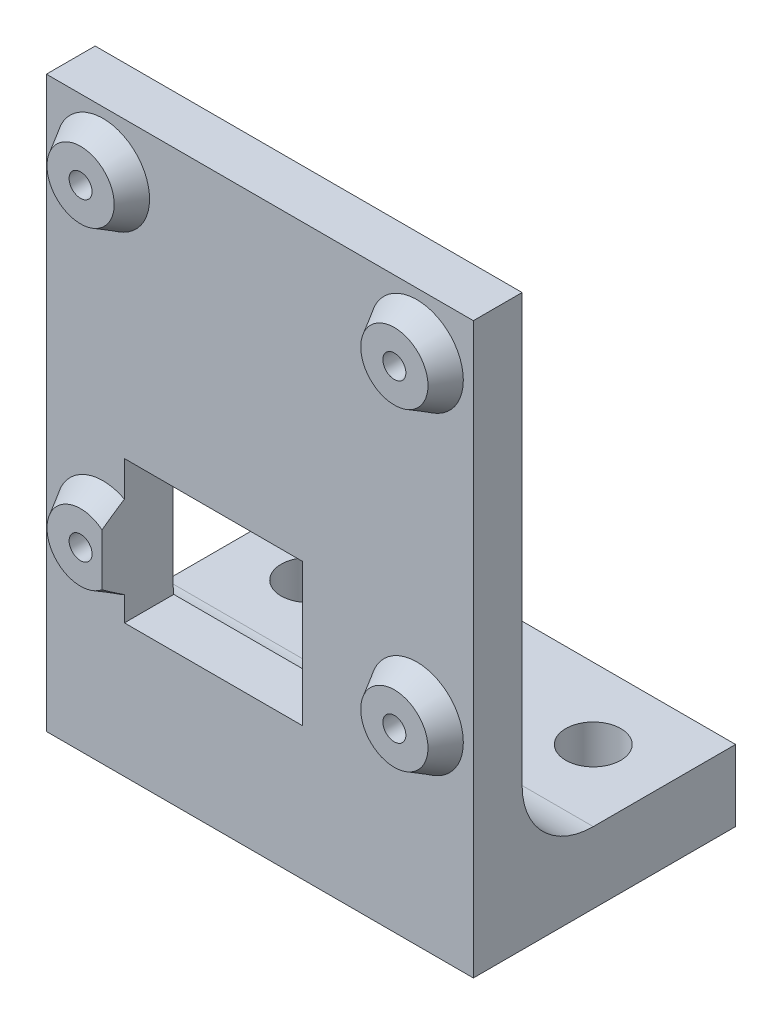
ISO-10303-21;
HEADER;
FILE_DESCRIPTION(('STEP AP214'),'2;1');
FILE_NAME('part.step','',(''),(''),'','','');
FILE_SCHEMA(('AUTOMOTIVE_DESIGN { 1 0 10303 214 1 1 1 1 }'));
ENDSEC;
DATA;
#1=APPLICATION_CONTEXT('core data for automotive mechanical design processes');
#2=APPLICATION_PROTOCOL_DEFINITION('international standard','automotive_design',2000,#1);
#3=PRODUCT_CONTEXT('',#1,'mechanical');
#4=PRODUCT('Part','Part','',(#3));
#5=PRODUCT_RELATED_PRODUCT_CATEGORY('part','',(#4));
#6=PRODUCT_DEFINITION_FORMATION('','',#4);
#7=PRODUCT_DEFINITION_CONTEXT('part definition',#1,'design');
#8=PRODUCT_DEFINITION('design','',#6,#7);
#9=PRODUCT_DEFINITION_SHAPE('','',#8);
#10=(LENGTH_UNIT() NAMED_UNIT(*) SI_UNIT(.MILLI.,.METRE.));
#11=(NAMED_UNIT(*) PLANE_ANGLE_UNIT() SI_UNIT($,.RADIAN.));
#12=(NAMED_UNIT(*) SI_UNIT($,.STERADIAN.) SOLID_ANGLE_UNIT());
#13=UNCERTAINTY_MEASURE_WITH_UNIT(LENGTH_MEASURE(1.E-05),#10,'distance_accuracy_value','');
#14=(GEOMETRIC_REPRESENTATION_CONTEXT(3) GLOBAL_UNCERTAINTY_ASSIGNED_CONTEXT((#13)) GLOBAL_UNIT_ASSIGNED_CONTEXT((#10,
#11,#12)) REPRESENTATION_CONTEXT('',''));
#15=CARTESIAN_POINT('',(0.,0.,0.));
#16=DIRECTION('',(0.,0.,1.));
#17=DIRECTION('',(1.,0.,0.));
#18=AXIS2_PLACEMENT_3D('',#15,#16,#17);
#19=CARTESIAN_POINT('',(19.05,50.8,0.));
#20=DIRECTION('',(0.,-1.,0.));
#21=DIRECTION('',(0.,0.,-1.));
#22=AXIS2_PLACEMENT_3D('',#19,#20,#21);
#23=PLANE('',#22);
#24=DIRECTION('',(-1.,0.,0.));
#25=VECTOR('',#24,1.);
#26=CARTESIAN_POINT('',(19.05,50.8,-2.));
#27=LINE('',#26,#25);
#28=CARTESIAN_POINT('',(19.05,50.8,-2.));
#29=VERTEX_POINT('',#28);
#30=CARTESIAN_POINT('',(-19.05,50.8,-2.));
#31=VERTEX_POINT('',#30);
#32=EDGE_CURVE('E196',#29,#31,#27,.T.);
#33=ORIENTED_EDGE('',*,*,#32,.F.);
#34=DIRECTION('',(0.,0.,1.));
#35=VECTOR('',#34,1.);
#36=CARTESIAN_POINT('',(19.05,50.8,0.));
#37=LINE('',#36,#35);
#38=CARTESIAN_POINT('',(19.05,50.8,-6.35));
#39=VERTEX_POINT('',#38);
#40=EDGE_CURVE('E233',#39,#29,#37,.T.);
#41=ORIENTED_EDGE('',*,*,#40,.F.);
#42=DIRECTION('',(-1.,0.,0.));
#43=VECTOR('',#42,1.);
#44=CARTESIAN_POINT('',(19.05,50.8,-6.35));
#45=LINE('',#44,#43);
#46=CARTESIAN_POINT('',(-19.05,50.8,-6.35));
#47=VERTEX_POINT('',#46);
#48=EDGE_CURVE('E255',#39,#47,#45,.T.);
#49=ORIENTED_EDGE('',*,*,#48,.T.);
#50=DIRECTION('',(0.,0.,1.));
#51=VECTOR('',#50,1.);
#52=CARTESIAN_POINT('',(-19.05,50.8,0.));
#53=LINE('',#52,#51);
#54=EDGE_CURVE('E249',#47,#31,#53,.T.);
#55=ORIENTED_EDGE('',*,*,#54,.T.);
#56=EDGE_LOOP('',(#33,#41,#49,#55));
#57=FACE_BOUND('',#56,.T.);
#58=ADVANCED_FACE('F50',(#57),#23,.F.);
#59=CARTESIAN_POINT('',(19.05,0.,0.));
#60=DIRECTION('',(0.,0.,-1.));
#61=DIRECTION('',(-1.,0.,0.));
#62=AXIS2_PLACEMENT_3D('',#59,#60,#61);
#63=PLANE('',#62);
#64=CARTESIAN_POINT('',(-14.,45.75,0.));
#65=DIRECTION('',(0.,0.,1.));
#66=DIRECTION('',(1.,0.,0.));
#67=AXIS2_PLACEMENT_3D('',#64,#65,#66);
#68=CIRCLE('',#67,1.025);
#69=CARTESIAN_POINT('',(-12.975,45.75,0.));
#70=VERTEX_POINT('',#69);
#71=EDGE_CURVE('E201',#70,#70,#68,.T.);
#72=ORIENTED_EDGE('',*,*,#71,.F.);
#73=EDGE_LOOP('',(#72));
#74=FACE_BOUND('',#73,.T.);
#75=CARTESIAN_POINT('',(-14.,45.75,0.));
#76=DIRECTION('',(0.,0.,1.));
#77=DIRECTION('',(1.,0.,0.));
#78=AXIS2_PLACEMENT_3D('',#75,#76,#77);
#79=CIRCLE('',#78,3.);
#80=CARTESIAN_POINT('',(-11.,45.75,0.));
#81=VERTEX_POINT('',#80);
#82=EDGE_CURVE('E184',#81,#81,#79,.T.);
#83=ORIENTED_EDGE('',*,*,#82,.T.);
#84=EDGE_LOOP('',(#83));
#85=FACE_BOUND('',#84,.T.);
#86=ADVANCED_FACE('F314',(#74,#85),#63,.F.);
#87=CARTESIAN_POINT('',(14.,45.75,0.));
#88=DIRECTION('',(0.,0.,1.));
#89=DIRECTION('',(1.,0.,0.));
#90=AXIS2_PLACEMENT_3D('',#87,#88,#89);
#91=CIRCLE('',#90,1.025);
#92=CARTESIAN_POINT('',(15.025,45.75,0.));
#93=VERTEX_POINT('',#92);
#94=EDGE_CURVE('E207',#93,#93,#91,.T.);
#95=ORIENTED_EDGE('',*,*,#94,.F.);
#96=EDGE_LOOP('',(#95));
#97=FACE_BOUND('',#96,.T.);
#98=CARTESIAN_POINT('',(14.,45.75,0.));
#99=DIRECTION('',(0.,0.,1.));
#100=DIRECTION('',(1.,0.,0.));
#101=AXIS2_PLACEMENT_3D('',#98,#99,#100);
#102=CIRCLE('',#101,3.);
#103=CARTESIAN_POINT('',(17.,45.75,0.));
#104=VERTEX_POINT('',#103);
#105=EDGE_CURVE('E180',#104,#104,#102,.T.);
#106=ORIENTED_EDGE('',*,*,#105,.T.);
#107=EDGE_LOOP('',(#106));
#108=FACE_BOUND('',#107,.T.);
#109=ADVANCED_FACE('F321',(#97,#108),#63,.F.);
#110=CARTESIAN_POINT('',(14.,17.75,0.));
#111=DIRECTION('',(0.,0.,1.));
#112=DIRECTION('',(1.,0.,0.));
#113=AXIS2_PLACEMENT_3D('',#110,#111,#112);
#114=CIRCLE('',#113,1.025);
#115=CARTESIAN_POINT('',(15.025,17.75,0.));
#116=VERTEX_POINT('',#115);
#117=EDGE_CURVE('E213',#116,#116,#114,.T.);
#118=ORIENTED_EDGE('',*,*,#117,.F.);
#119=EDGE_LOOP('',(#118));
#120=FACE_BOUND('',#119,.T.);
#121=CARTESIAN_POINT('',(14.,17.75,0.));
#122=DIRECTION('',(0.,0.,1.));
#123=DIRECTION('',(1.,0.,0.));
#124=AXIS2_PLACEMENT_3D('',#121,#122,#123);
#125=CIRCLE('',#124,3.);
#126=CARTESIAN_POINT('',(17.,17.75,0.));
#127=VERTEX_POINT('',#126);
#128=EDGE_CURVE('E170',#127,#127,#125,.T.);
#129=ORIENTED_EDGE('',*,*,#128,.T.);
#130=EDGE_LOOP('',(#129));
#131=FACE_BOUND('',#130,.T.);
#132=ADVANCED_FACE('F458',(#120,#131),#63,.F.);
#133=CARTESIAN_POINT('',(-14.,17.75,0.));
#134=DIRECTION('',(0.,0.,1.));
#135=DIRECTION('',(1.,0.,0.));
#136=AXIS2_PLACEMENT_3D('',#133,#134,#135);
#137=CIRCLE('',#136,1.025);
#138=CARTESIAN_POINT('',(-12.975,17.75,0.));
#139=VERTEX_POINT('',#138);
#140=EDGE_CURVE('E219',#139,#139,#137,.T.);
#141=ORIENTED_EDGE('',*,*,#140,.F.);
#142=EDGE_LOOP('',(#141));
#143=FACE_BOUND('',#142,.T.);
#144=CARTESIAN_POINT('',(-14.,17.75,0.));
#145=DIRECTION('',(0.,0.,1.));
#146=DIRECTION('',(1.,0.,0.));
#147=AXIS2_PLACEMENT_3D('',#144,#145,#146);
#148=CIRCLE('',#147,3.);
#149=CARTESIAN_POINT('',(-12.0875,20.0613510659352,0.));
#150=VERTEX_POINT('',#149);
#151=CARTESIAN_POINT('',(-12.0875,15.4386489340647,0.));
#152=VERTEX_POINT('',#151);
#153=EDGE_CURVE('E162',#150,#152,#148,.T.);
#154=ORIENTED_EDGE('',*,*,#153,.T.);
#155=DIRECTION('',(0.,-1.,0.));
#156=VECTOR('',#155,1.);
#157=CARTESIAN_POINT('',(-12.0875,24.575,0.));
#158=LINE('',#157,#156);
#159=EDGE_CURVE('E73',#150,#152,#158,.T.);
#160=ORIENTED_EDGE('',*,*,#159,.F.);
#161=EDGE_LOOP('',(#154,#160));
#162=FACE_BOUND('',#161,.T.);
#163=ADVANCED_FACE('F161',(#143,#162),#63,.F.);
#164=CARTESIAN_POINT('',(19.05,0.,-25.4));
#165=DIRECTION('',(0.,1.,0.));
#166=DIRECTION('',(0.,0.,1.));
#167=AXIS2_PLACEMENT_3D('',#164,#165,#166);
#168=PLANE('',#167);
#169=CARTESIAN_POINT('',(-12.7,0.,-19.05));
#170=DIRECTION('',(0.,1.,0.));
#171=DIRECTION('',(0.,0.,1.));
#172=AXIS2_PLACEMENT_3D('',#169,#170,#171);
#173=CIRCLE('',#172,2.45745);
#174=CARTESIAN_POINT('',(-12.7,0.,-16.59255));
#175=VERTEX_POINT('',#174);
#176=EDGE_CURVE('E413',#175,#175,#173,.T.);
#177=ORIENTED_EDGE('',*,*,#176,.T.);
#178=EDGE_LOOP('',(#177));
#179=FACE_BOUND('',#178,.T.);
#180=CARTESIAN_POINT('',(0.,0.,-19.05));
#181=DIRECTION('',(0.,1.,0.));
#182=DIRECTION('',(0.,0.,1.));
#183=AXIS2_PLACEMENT_3D('',#180,#181,#182);
#184=CIRCLE('',#183,2.45745);
#185=CARTESIAN_POINT('',(0.,0.,-16.59255));
#186=VERTEX_POINT('',#185);
#187=EDGE_CURVE('E409',#186,#186,#184,.T.);
#188=ORIENTED_EDGE('',*,*,#187,.T.);
#189=EDGE_LOOP('',(#188));
#190=FACE_BOUND('',#189,.T.);
#191=CARTESIAN_POINT('',(12.7,0.,-19.05));
#192=DIRECTION('',(0.,1.,0.));
#193=DIRECTION('',(0.,0.,1.));
#194=AXIS2_PLACEMENT_3D('',#191,#192,#193);
#195=CIRCLE('',#194,2.45745);
#196=CARTESIAN_POINT('',(12.7,0.,-16.59255));
#197=VERTEX_POINT('',#196);
#198=EDGE_CURVE('E164',#197,#197,#195,.T.);
#199=ORIENTED_EDGE('',*,*,#198,.T.);
#200=EDGE_LOOP('',(#199));
#201=FACE_BOUND('',#200,.T.);
#202=DIRECTION('',(1.,0.,0.));
#203=VECTOR('',#202,1.);
#204=CARTESIAN_POINT('',(19.05,0.,-2.));
#205=LINE('',#204,#203);
#206=CARTESIAN_POINT('',(-19.05,0.,-2.));
#207=VERTEX_POINT('',#206);
#208=CARTESIAN_POINT('',(19.05,0.,-2.));
#209=VERTEX_POINT('',#208);
#210=EDGE_CURVE('E190',#207,#209,#205,.T.);
#211=ORIENTED_EDGE('',*,*,#210,.F.);
#212=DIRECTION('',(0.,0.,-1.));
#213=VECTOR('',#212,1.);
#214=CARTESIAN_POINT('',(-19.05,0.,-25.4));
#215=LINE('',#214,#213);
#216=CARTESIAN_POINT('',(-19.05,0.,-25.4));
#217=VERTEX_POINT('',#216);
#218=EDGE_CURVE('E227',#207,#217,#215,.T.);
#219=ORIENTED_EDGE('',*,*,#218,.T.);
#220=DIRECTION('',(-1.,0.,0.));
#221=VECTOR('',#220,1.);
#222=CARTESIAN_POINT('',(19.05,0.,-25.4));
#223=LINE('',#222,#221);
#224=CARTESIAN_POINT('',(19.05,0.,-25.4));
#225=VERTEX_POINT('',#224);
#226=EDGE_CURVE('E238',#225,#217,#223,.T.);
#227=ORIENTED_EDGE('',*,*,#226,.F.);
#228=DIRECTION('',(0.,0.,-1.));
#229=VECTOR('',#228,1.);
#230=CARTESIAN_POINT('',(19.05,0.,-25.4));
#231=LINE('',#230,#229);
#232=EDGE_CURVE('E236',#209,#225,#231,.T.);
#233=ORIENTED_EDGE('',*,*,#232,.F.);
#234=EDGE_LOOP('',(#211,#219,#227,#233));
#235=FACE_BOUND('',#234,.T.);
#236=ADVANCED_FACE('F434',(#179,#190,#201,#235),#168,.F.);
#237=CARTESIAN_POINT('',(19.05,12.7,-12.7));
#238=DIRECTION('',(1.,0.,0.));
#239=DIRECTION('',(0.,0.,-1.));
#240=AXIS2_PLACEMENT_3D('',#237,#238,#239);
#241=PLANE('',#240);
#242=ORIENTED_EDGE('',*,*,#40,.T.);
#243=DIRECTION('',(0.,-1.,0.));
#244=VECTOR('',#243,1.);
#245=CARTESIAN_POINT('',(19.05,12.7,-2.));
#246=LINE('',#245,#244);
#247=EDGE_CURVE('E198',#29,#209,#246,.T.);
#248=ORIENTED_EDGE('',*,*,#247,.T.);
#249=ORIENTED_EDGE('',*,*,#232,.T.);
#250=DIRECTION('',(0.,1.,0.));
#251=VECTOR('',#250,1.);
#252=CARTESIAN_POINT('',(19.05,6.35,-25.4));
#253=LINE('',#252,#251);
#254=CARTESIAN_POINT('',(19.05,6.35,-25.4));
#255=VERTEX_POINT('',#254);
#256=EDGE_CURVE('E223',#225,#255,#253,.T.);
#257=ORIENTED_EDGE('',*,*,#256,.T.);
#258=DIRECTION('',(0.,0.,1.));
#259=VECTOR('',#258,1.);
#260=CARTESIAN_POINT('',(19.05,6.35,-12.7));
#261=LINE('',#260,#259);
#262=CARTESIAN_POINT('',(19.05,6.35,-12.7));
#263=VERTEX_POINT('',#262);
#264=EDGE_CURVE('E226',#255,#263,#261,.T.);
#265=ORIENTED_EDGE('',*,*,#264,.T.);
#266=CARTESIAN_POINT('',(19.05,12.7,-12.7));
#267=DIRECTION('',(-1.,0.,0.));
#268=DIRECTION('',(0.,0.,-1.));
#269=AXIS2_PLACEMENT_3D('',#266,#267,#268);
#270=CIRCLE('',#269,6.35);
#271=CARTESIAN_POINT('',(19.05,12.7,-6.35));
#272=VERTEX_POINT('',#271);
#273=EDGE_CURVE('E229',#263,#272,#270,.T.);
#274=ORIENTED_EDGE('',*,*,#273,.T.);
#275=DIRECTION('',(0.,1.,0.));
#276=VECTOR('',#275,1.);
#277=CARTESIAN_POINT('',(19.05,50.8,-6.35));
#278=LINE('',#277,#276);
#279=EDGE_CURVE('E231',#272,#39,#278,.T.);
#280=ORIENTED_EDGE('',*,*,#279,.T.);
#281=EDGE_LOOP('',(#242,#248,#249,#257,#265,#274,#280));
#282=FACE_BOUND('',#281,.T.);
#283=ADVANCED_FACE('F374',(#282),#241,.T.);
#284=CARTESIAN_POINT('',(-19.05,12.7,-12.7));
#285=DIRECTION('',(1.,0.,0.));
#286=DIRECTION('',(0.,0.,-1.));
#287=AXIS2_PLACEMENT_3D('',#284,#285,#286);
#288=PLANE('',#287);
#289=DIRECTION('',(0.,-1.,0.));
#290=VECTOR('',#289,1.);
#291=CARTESIAN_POINT('',(-19.05,12.7,-2.));
#292=LINE('',#291,#290);
#293=EDGE_CURVE('E268',#31,#207,#292,.T.);
#294=ORIENTED_EDGE('',*,*,#293,.F.);
#295=ORIENTED_EDGE('',*,*,#54,.F.);
#296=DIRECTION('',(0.,1.,0.));
#297=VECTOR('',#296,1.);
#298=CARTESIAN_POINT('',(-19.05,50.8,-6.35));
#299=LINE('',#298,#297);
#300=CARTESIAN_POINT('',(-19.05,12.7,-6.35));
#301=VERTEX_POINT('',#300);
#302=EDGE_CURVE('E247',#301,#47,#299,.T.);
#303=ORIENTED_EDGE('',*,*,#302,.F.);
#304=CARTESIAN_POINT('',(-19.05,12.7,-12.7));
#305=DIRECTION('',(-1.,0.,0.));
#306=DIRECTION('',(0.,0.,-1.));
#307=AXIS2_PLACEMENT_3D('',#304,#305,#306);
#308=CIRCLE('',#307,6.35);
#309=CARTESIAN_POINT('',(-19.05,6.35,-12.7));
#310=VERTEX_POINT('',#309);
#311=EDGE_CURVE('E244',#310,#301,#308,.T.);
#312=ORIENTED_EDGE('',*,*,#311,.F.);
#313=DIRECTION('',(0.,0.,1.));
#314=VECTOR('',#313,1.);
#315=CARTESIAN_POINT('',(-19.05,6.35,-12.7));
#316=LINE('',#315,#314);
#317=CARTESIAN_POINT('',(-19.05,6.35,-25.4));
#318=VERTEX_POINT('',#317);
#319=EDGE_CURVE('E242',#318,#310,#316,.T.);
#320=ORIENTED_EDGE('',*,*,#319,.F.);
#321=DIRECTION('',(0.,1.,0.));
#322=VECTOR('',#321,1.);
#323=CARTESIAN_POINT('',(-19.05,6.35,-25.4));
#324=LINE('',#323,#322);
#325=EDGE_CURVE('E239',#217,#318,#324,.T.);
#326=ORIENTED_EDGE('',*,*,#325,.F.);
#327=ORIENTED_EDGE('',*,*,#218,.F.);
#328=EDGE_LOOP('',(#294,#295,#303,#312,#320,#326,#327));
#329=FACE_BOUND('',#328,.T.);
#330=ADVANCED_FACE('F342',(#329),#288,.F.);
#331=CARTESIAN_POINT('',(19.05,6.35,-25.4));
#332=DIRECTION('',(0.,0.,1.));
#333=DIRECTION('',(1.,0.,0.));
#334=AXIS2_PLACEMENT_3D('',#331,#332,#333);
#335=PLANE('',#334);
#336=ORIENTED_EDGE('',*,*,#325,.T.);
#337=DIRECTION('',(-1.,0.,0.));
#338=VECTOR('',#337,1.);
#339=CARTESIAN_POINT('',(19.05,6.35,-25.4));
#340=LINE('',#339,#338);
#341=EDGE_CURVE('E265',#255,#318,#340,.T.);
#342=ORIENTED_EDGE('',*,*,#341,.F.);
#343=ORIENTED_EDGE('',*,*,#256,.F.);
#344=ORIENTED_EDGE('',*,*,#226,.T.);
#345=EDGE_LOOP('',(#336,#342,#343,#344));
#346=FACE_BOUND('',#345,.T.);
#347=ADVANCED_FACE('F52',(#346),#335,.F.);
#348=CARTESIAN_POINT('',(19.05,6.35,-12.7));
#349=DIRECTION('',(0.,-1.,0.));
#350=DIRECTION('',(0.,0.,-1.));
#351=AXIS2_PLACEMENT_3D('',#348,#349,#350);
#352=PLANE('',#351);
#353=CARTESIAN_POINT('',(-12.7,6.34999999999999,-19.05));
#354=DIRECTION('',(0.,1.,0.));
#355=DIRECTION('',(0.,0.,1.));
#356=AXIS2_PLACEMENT_3D('',#353,#354,#355);
#357=CIRCLE('',#356,2.45745);
#358=CARTESIAN_POINT('',(-12.7,6.34999999999999,-16.59255));
#359=VERTEX_POINT('',#358);
#360=EDGE_CURVE('E347',#359,#359,#357,.T.);
#361=ORIENTED_EDGE('',*,*,#360,.F.);
#362=EDGE_LOOP('',(#361));
#363=FACE_BOUND('',#362,.T.);
#364=CARTESIAN_POINT('',(0.,6.34999999999999,-19.05));
#365=DIRECTION('',(0.,1.,0.));
#366=DIRECTION('',(0.,0.,1.));
#367=AXIS2_PLACEMENT_3D('',#364,#365,#366);
#368=CIRCLE('',#367,2.45745);
#369=CARTESIAN_POINT('',(0.,6.34999999999999,-16.59255));
#370=VERTEX_POINT('',#369);
#371=EDGE_CURVE('E351',#370,#370,#368,.T.);
#372=ORIENTED_EDGE('',*,*,#371,.F.);
#373=EDGE_LOOP('',(#372));
#374=FACE_BOUND('',#373,.T.);
#375=CARTESIAN_POINT('',(12.7,6.34999999999999,-19.05));
#376=DIRECTION('',(0.,1.,0.));
#377=DIRECTION('',(0.,0.,1.));
#378=AXIS2_PLACEMENT_3D('',#375,#376,#377);
#379=CIRCLE('',#378,2.45745);
#380=CARTESIAN_POINT('',(12.7,6.34999999999999,-16.59255));
#381=VERTEX_POINT('',#380);
#382=EDGE_CURVE('E355',#381,#381,#379,.T.);
#383=ORIENTED_EDGE('',*,*,#382,.F.);
#384=EDGE_LOOP('',(#383));
#385=FACE_BOUND('',#384,.T.);
#386=ORIENTED_EDGE('',*,*,#319,.T.);
#387=DIRECTION('',(-1.,0.,0.));
#388=VECTOR('',#387,1.);
#389=CARTESIAN_POINT('',(19.05,6.35,-12.7));
#390=LINE('',#389,#388);
#391=EDGE_CURVE('E262',#263,#310,#390,.T.);
#392=ORIENTED_EDGE('',*,*,#391,.F.);
#393=ORIENTED_EDGE('',*,*,#264,.F.);
#394=ORIENTED_EDGE('',*,*,#341,.T.);
#395=EDGE_LOOP('',(#386,#392,#393,#394));
#396=FACE_BOUND('',#395,.T.);
#397=ADVANCED_FACE('F333',(#363,#374,#385,#396),#352,.F.);
#398=CARTESIAN_POINT('',(19.05,12.7,-12.7));
#399=DIRECTION('',(-1.,0.,0.));
#400=DIRECTION('',(0.,0.,1.));
#401=AXIS2_PLACEMENT_3D('',#398,#399,#400);
#402=CYLINDRICAL_SURFACE('',#401,6.35);
#403=DIRECTION('',(-1.,0.,0.));
#404=VECTOR('',#403,1.);
#405=CARTESIAN_POINT('',(19.05,11.875,-6.40382060293705));
#406=LINE('',#405,#404);
#407=CARTESIAN_POINT('',(-12.0875,11.875,-6.40382060293705));
#408=VERTEX_POINT('',#407);
#409=CARTESIAN_POINT('',(3.7875,11.875,-6.40382060293705));
#410=VERTEX_POINT('',#409);
#411=EDGE_CURVE('E379',#408,#410,#406,.F.);
#412=ORIENTED_EDGE('',*,*,#411,.T.);
#413=CARTESIAN_POINT('',(3.7875,12.7,-12.7));
#414=DIRECTION('',(1.,0.,0.));
#415=DIRECTION('',(0.,0.,-1.));
#416=AXIS2_PLACEMENT_3D('',#413,#414,#415);
#417=CIRCLE('',#416,6.35);
#418=CARTESIAN_POINT('',(3.7875,12.7,-6.35));
#419=VERTEX_POINT('',#418);
#420=EDGE_CURVE('E168',#410,#419,#417,.F.);
#421=ORIENTED_EDGE('',*,*,#420,.T.);
#422=DIRECTION('',(-1.,0.,0.));
#423=VECTOR('',#422,1.);
#424=CARTESIAN_POINT('',(19.05,12.7,-6.35));
#425=LINE('',#424,#423);
#426=EDGE_CURVE('E259',#272,#419,#425,.T.);
#427=ORIENTED_EDGE('',*,*,#426,.F.);
#428=ORIENTED_EDGE('',*,*,#273,.F.);
#429=ORIENTED_EDGE('',*,*,#391,.T.);
#430=ORIENTED_EDGE('',*,*,#311,.T.);
#431=CARTESIAN_POINT('',(-12.0875,12.7,-6.35));
#432=VERTEX_POINT('',#431);
#433=EDGE_CURVE('E258',#432,#301,#425,.T.);
#434=ORIENTED_EDGE('',*,*,#433,.F.);
#435=CARTESIAN_POINT('',(-12.0875,12.7,-12.7));
#436=DIRECTION('',(-1.,0.,0.));
#437=DIRECTION('',(0.,-1.,0.));
#438=AXIS2_PLACEMENT_3D('',#435,#436,#437);
#439=CIRCLE('',#438,6.35);
#440=EDGE_CURVE('E401',#432,#408,#439,.F.);
#441=ORIENTED_EDGE('',*,*,#440,.T.);
#442=EDGE_LOOP('',(#412,#421,#427,#428,#429,#430,#434,#441));
#443=FACE_BOUND('',#442,.T.);
#444=ADVANCED_FACE('F330',(#443),#402,.F.);
#445=CARTESIAN_POINT('',(19.05,50.8,-6.35));
#446=DIRECTION('',(0.,0.,1.));
#447=DIRECTION('',(0.,-1.,0.));
#448=AXIS2_PLACEMENT_3D('',#445,#446,#447);
#449=PLANE('',#448);
#450=ORIENTED_EDGE('',*,*,#426,.T.);
#451=DIRECTION('',(0.,1.,0.));
#452=VECTOR('',#451,1.);
#453=CARTESIAN_POINT('',(3.7875,50.8,-6.35));
#454=LINE('',#453,#452);
#455=CARTESIAN_POINT('',(3.7875,24.575,-6.35));
#456=VERTEX_POINT('',#455);
#457=EDGE_CURVE('E173',#419,#456,#454,.T.);
#458=ORIENTED_EDGE('',*,*,#457,.T.);
#459=DIRECTION('',(-1.,0.,0.));
#460=VECTOR('',#459,1.);
#461=CARTESIAN_POINT('',(19.05,24.575,-6.35));
#462=LINE('',#461,#460);
#463=CARTESIAN_POINT('',(-12.0875,24.575,-6.35));
#464=VERTEX_POINT('',#463);
#465=EDGE_CURVE('E403',#456,#464,#462,.T.);
#466=ORIENTED_EDGE('',*,*,#465,.T.);
#467=DIRECTION('',(0.,-1.,0.));
#468=VECTOR('',#467,1.);
#469=CARTESIAN_POINT('',(-12.0875,50.8,-6.35));
#470=LINE('',#469,#468);
#471=EDGE_CURVE('E399',#464,#432,#470,.T.);
#472=ORIENTED_EDGE('',*,*,#471,.T.);
#473=ORIENTED_EDGE('',*,*,#433,.T.);
#474=ORIENTED_EDGE('',*,*,#302,.T.);
#475=ORIENTED_EDGE('',*,*,#48,.F.);
#476=ORIENTED_EDGE('',*,*,#279,.F.);
#477=EDGE_LOOP('',(#450,#458,#466,#472,#473,#474,#475,#476));
#478=FACE_BOUND('',#477,.T.);
#479=CARTESIAN_POINT('',(-14.,45.75,-6.35));
#480=DIRECTION('',(0.,0.,1.));
#481=DIRECTION('',(0.,-1.,0.));
#482=AXIS2_PLACEMENT_3D('',#479,#480,#481);
#483=CIRCLE('',#482,1.025);
#484=CARTESIAN_POINT('',(-14.,44.725,-6.35));
#485=VERTEX_POINT('',#484);
#486=EDGE_CURVE('E204',#485,#485,#483,.T.);
#487=ORIENTED_EDGE('',*,*,#486,.T.);
#488=EDGE_LOOP('',(#487));
#489=FACE_BOUND('',#488,.T.);
#490=CARTESIAN_POINT('',(14.,45.75,-6.35));
#491=DIRECTION('',(0.,0.,1.));
#492=DIRECTION('',(0.,-1.,0.));
#493=AXIS2_PLACEMENT_3D('',#490,#491,#492);
#494=CIRCLE('',#493,1.025);
#495=CARTESIAN_POINT('',(14.,44.725,-6.35));
#496=VERTEX_POINT('',#495);
#497=EDGE_CURVE('E210',#496,#496,#494,.T.);
#498=ORIENTED_EDGE('',*,*,#497,.T.);
#499=EDGE_LOOP('',(#498));
#500=FACE_BOUND('',#499,.T.);
#501=CARTESIAN_POINT('',(14.,17.75,-6.35));
#502=DIRECTION('',(0.,0.,1.));
#503=DIRECTION('',(0.,-1.,0.));
#504=AXIS2_PLACEMENT_3D('',#501,#502,#503);
#505=CIRCLE('',#504,1.025);
#506=CARTESIAN_POINT('',(14.,16.725,-6.35));
#507=VERTEX_POINT('',#506);
#508=EDGE_CURVE('E216',#507,#507,#505,.T.);
#509=ORIENTED_EDGE('',*,*,#508,.T.);
#510=EDGE_LOOP('',(#509));
#511=FACE_BOUND('',#510,.T.);
#512=CARTESIAN_POINT('',(-14.,17.75,-6.35));
#513=DIRECTION('',(0.,0.,1.));
#514=DIRECTION('',(0.,-1.,0.));
#515=AXIS2_PLACEMENT_3D('',#512,#513,#514);
#516=CIRCLE('',#515,1.025);
#517=CARTESIAN_POINT('',(-14.,16.725,-6.35));
#518=VERTEX_POINT('',#517);
#519=EDGE_CURVE('E222',#518,#518,#516,.T.);
#520=ORIENTED_EDGE('',*,*,#519,.T.);
#521=EDGE_LOOP('',(#520));
#522=FACE_BOUND('',#521,.T.);
#523=ADVANCED_FACE('F327',(#478,#489,#500,#511,#522),#449,.F.);
#524=CARTESIAN_POINT('',(-14.,17.75,0.));
#525=DIRECTION('',(0.,0.,1.));
#526=DIRECTION('',(1.,0.,0.));
#527=AXIS2_PLACEMENT_3D('',#524,#525,#526);
#528=CYLINDRICAL_SURFACE('',#527,1.025);
#529=ORIENTED_EDGE('',*,*,#140,.T.);
#530=EDGE_LOOP('',(#529));
#531=FACE_BOUND('',#530,.T.);
#532=ORIENTED_EDGE('',*,*,#519,.F.);
#533=EDGE_LOOP('',(#532));
#534=FACE_BOUND('',#533,.T.);
#535=ADVANCED_FACE('F329',(#531,#534),#528,.F.);
#536=CARTESIAN_POINT('',(14.,17.75,0.));
#537=DIRECTION('',(0.,0.,1.));
#538=DIRECTION('',(1.,0.,0.));
#539=AXIS2_PLACEMENT_3D('',#536,#537,#538);
#540=CYLINDRICAL_SURFACE('',#539,1.025);
#541=ORIENTED_EDGE('',*,*,#117,.T.);
#542=EDGE_LOOP('',(#541));
#543=FACE_BOUND('',#542,.T.);
#544=ORIENTED_EDGE('',*,*,#508,.F.);
#545=EDGE_LOOP('',(#544));
#546=FACE_BOUND('',#545,.T.);
#547=ADVANCED_FACE('F468',(#543,#546),#540,.F.);
#548=CARTESIAN_POINT('',(14.,45.75,0.));
#549=DIRECTION('',(0.,0.,1.));
#550=DIRECTION('',(1.,0.,0.));
#551=AXIS2_PLACEMENT_3D('',#548,#549,#550);
#552=CYLINDRICAL_SURFACE('',#551,1.025);
#553=ORIENTED_EDGE('',*,*,#94,.T.);
#554=EDGE_LOOP('',(#553));
#555=FACE_BOUND('',#554,.T.);
#556=ORIENTED_EDGE('',*,*,#497,.F.);
#557=EDGE_LOOP('',(#556));
#558=FACE_BOUND('',#557,.T.);
#559=ADVANCED_FACE('F308',(#555,#558),#552,.F.);
#560=CARTESIAN_POINT('',(-14.,45.75,0.));
#561=DIRECTION('',(0.,0.,1.));
#562=DIRECTION('',(1.,0.,0.));
#563=AXIS2_PLACEMENT_3D('',#560,#561,#562);
#564=CYLINDRICAL_SURFACE('',#563,1.025);
#565=ORIENTED_EDGE('',*,*,#71,.T.);
#566=EDGE_LOOP('',(#565));
#567=FACE_BOUND('',#566,.T.);
#568=ORIENTED_EDGE('',*,*,#486,.F.);
#569=EDGE_LOOP('',(#568));
#570=FACE_BOUND('',#569,.T.);
#571=ADVANCED_FACE('F297',(#567,#570),#564,.F.);
#572=CARTESIAN_POINT('',(0.,25.4,-2.));
#573=DIRECTION('',(0.,0.,1.));
#574=DIRECTION('',(1.,0.,0.));
#575=AXIS2_PLACEMENT_3D('',#572,#573,#574);
#576=PLANE('',#575);
#577=DIRECTION('',(0.,-1.,0.));
#578=VECTOR('',#577,1.);
#579=CARTESIAN_POINT('',(-12.0875,25.4,-2.));
#580=LINE('',#579,#578);
#581=CARTESIAN_POINT('',(-12.0875,14.061656155724,-2.));
#582=VERTEX_POINT('',#581);
#583=CARTESIAN_POINT('',(-12.0875,11.875,-2.));
#584=VERTEX_POINT('',#583);
#585=EDGE_CURVE('E389',#582,#584,#580,.T.);
#586=ORIENTED_EDGE('',*,*,#585,.F.);
#587=CARTESIAN_POINT('',(-14.,17.75,-2.));
#588=DIRECTION('',(0.,0.,1.));
#589=DIRECTION('',(1.,0.,0.));
#590=AXIS2_PLACEMENT_3D('',#587,#588,#589);
#591=CIRCLE('',#590,4.15470053837925);
#592=CARTESIAN_POINT('',(-12.0875,21.438343844276,-2.));
#593=VERTEX_POINT('',#592);
#594=EDGE_CURVE('E167',#593,#582,#591,.T.);
#595=ORIENTED_EDGE('',*,*,#594,.F.);
#596=CARTESIAN_POINT('',(-12.0875,24.575,-2.));
#597=VERTEX_POINT('',#596);
#598=EDGE_CURVE('E151',#597,#593,#580,.T.);
#599=ORIENTED_EDGE('',*,*,#598,.F.);
#600=DIRECTION('',(-1.,0.,0.));
#601=VECTOR('',#600,1.);
#602=CARTESIAN_POINT('',(0.,24.575,-2.));
#603=LINE('',#602,#601);
#604=CARTESIAN_POINT('',(3.7875,24.575,-2.));
#605=VERTEX_POINT('',#604);
#606=EDGE_CURVE('E156',#605,#597,#603,.T.);
#607=ORIENTED_EDGE('',*,*,#606,.F.);
#608=DIRECTION('',(0.,1.,0.));
#609=VECTOR('',#608,1.);
#610=CARTESIAN_POINT('',(3.7875,25.4,-2.));
#611=LINE('',#610,#609);
#612=CARTESIAN_POINT('',(3.7875,11.875,-2.));
#613=VERTEX_POINT('',#612);
#614=EDGE_CURVE('E58',#613,#605,#611,.T.);
#615=ORIENTED_EDGE('',*,*,#614,.F.);
#616=DIRECTION('',(1.,0.,0.));
#617=VECTOR('',#616,1.);
#618=CARTESIAN_POINT('',(0.,11.875,-2.));
#619=LINE('',#618,#617);
#620=EDGE_CURVE('E12',#584,#613,#619,.T.);
#621=ORIENTED_EDGE('',*,*,#620,.F.);
#622=EDGE_LOOP('',(#586,#595,#599,#607,#615,#621));
#623=FACE_BOUND('',#622,.T.);
#624=ORIENTED_EDGE('',*,*,#32,.T.);
#625=ORIENTED_EDGE('',*,*,#293,.T.);
#626=ORIENTED_EDGE('',*,*,#210,.T.);
#627=ORIENTED_EDGE('',*,*,#247,.F.);
#628=EDGE_LOOP('',(#624,#625,#626,#627));
#629=FACE_BOUND('',#628,.T.);
#630=CARTESIAN_POINT('',(14.,17.75,-2.));
#631=DIRECTION('',(0.,0.,1.));
#632=DIRECTION('',(1.,0.,0.));
#633=AXIS2_PLACEMENT_3D('',#630,#631,#632);
#634=CIRCLE('',#633,4.15470053837925);
#635=CARTESIAN_POINT('',(18.1547005383793,17.75,-2.));
#636=VERTEX_POINT('',#635);
#637=EDGE_CURVE('E179',#636,#636,#634,.T.);
#638=ORIENTED_EDGE('',*,*,#637,.F.);
#639=EDGE_LOOP('',(#638));
#640=FACE_BOUND('',#639,.T.);
#641=CARTESIAN_POINT('',(14.,45.75,-2.));
#642=DIRECTION('',(0.,0.,1.));
#643=DIRECTION('',(1.,0.,0.));
#644=AXIS2_PLACEMENT_3D('',#641,#642,#643);
#645=CIRCLE('',#644,4.15470053837926);
#646=CARTESIAN_POINT('',(18.1547005383793,45.75,-2.));
#647=VERTEX_POINT('',#646);
#648=EDGE_CURVE('E183',#647,#647,#645,.T.);
#649=ORIENTED_EDGE('',*,*,#648,.F.);
#650=EDGE_LOOP('',(#649));
#651=FACE_BOUND('',#650,.T.);
#652=CARTESIAN_POINT('',(-14.,45.75,-2.));
#653=DIRECTION('',(0.,0.,1.));
#654=DIRECTION('',(1.,0.,0.));
#655=AXIS2_PLACEMENT_3D('',#652,#653,#654);
#656=CIRCLE('',#655,4.15470053837926);
#657=CARTESIAN_POINT('',(-9.84529946162074,45.75,-2.));
#658=VERTEX_POINT('',#657);
#659=EDGE_CURVE('E186',#658,#658,#656,.T.);
#660=ORIENTED_EDGE('',*,*,#659,.F.);
#661=EDGE_LOOP('',(#660));
#662=FACE_BOUND('',#661,.T.);
#663=ADVANCED_FACE('F294',(#623,#629,#640,#651,#662),#576,.T.);
#664=CARTESIAN_POINT('',(-14.,45.75,0.));
#665=DIRECTION('',(0.,0.,-1.));
#666=DIRECTION('',(1.,0.,0.));
#667=AXIS2_PLACEMENT_3D('',#664,#665,#666);
#668=CONICAL_SURFACE('',#667,3.,0.5235987755983);
#669=ORIENTED_EDGE('',*,*,#659,.T.);
#670=EDGE_LOOP('',(#669));
#671=FACE_BOUND('',#670,.T.);
#672=ORIENTED_EDGE('',*,*,#82,.F.);
#673=EDGE_LOOP('',(#672));
#674=FACE_BOUND('',#673,.T.);
#675=ADVANCED_FACE('F296',(#671,#674),#668,.T.);
#676=CARTESIAN_POINT('',(14.,45.75,0.));
#677=DIRECTION('',(0.,0.,-1.));
#678=DIRECTION('',(1.,0.,0.));
#679=AXIS2_PLACEMENT_3D('',#676,#677,#678);
#680=CONICAL_SURFACE('',#679,3.,0.5235987755983);
#681=ORIENTED_EDGE('',*,*,#648,.T.);
#682=EDGE_LOOP('',(#681));
#683=FACE_BOUND('',#682,.T.);
#684=ORIENTED_EDGE('',*,*,#105,.F.);
#685=EDGE_LOOP('',(#684));
#686=FACE_BOUND('',#685,.T.);
#687=ADVANCED_FACE('F304',(#683,#686),#680,.T.);
#688=CARTESIAN_POINT('',(14.,17.75,0.));
#689=DIRECTION('',(0.,0.,-1.));
#690=DIRECTION('',(1.,0.,0.));
#691=AXIS2_PLACEMENT_3D('',#688,#689,#690);
#692=CONICAL_SURFACE('',#691,3.,0.5235987755983);
#693=ORIENTED_EDGE('',*,*,#637,.T.);
#694=EDGE_LOOP('',(#693));
#695=FACE_BOUND('',#694,.T.);
#696=ORIENTED_EDGE('',*,*,#128,.F.);
#697=EDGE_LOOP('',(#696));
#698=FACE_BOUND('',#697,.T.);
#699=ADVANCED_FACE('F453',(#695,#698),#692,.T.);
#700=CARTESIAN_POINT('',(-14.,17.75,0.));
#701=DIRECTION('',(0.,0.,-1.));
#702=DIRECTION('',(1.,0.,0.));
#703=AXIS2_PLACEMENT_3D('',#700,#701,#702);
#704=CONICAL_SURFACE('',#703,3.,0.5235987755983);
#705=CARTESIAN_POINT('',(-12.0875,21.4387990839035,-2.00070000000028));
#706=CARTESIAN_POINT('',(-12.0875,21.3757801168931,-1.90380214523002));
#707=CARTESIAN_POINT('',(-12.0875,21.3125250969816,-1.80705750881669));
#708=CARTESIAN_POINT('',(-12.0875,21.1854563926195,-1.61393232094737));
#709=CARTESIAN_POINT('',(-12.0875,21.1216426936208,-1.51755177906664));
#710=CARTESIAN_POINT('',(-12.0875,20.9291440553271,-1.22890846013178));
#711=CARTESIAN_POINT('',(-12.0875,20.7994943105716,-1.03728714466088));
#712=CARTESIAN_POINT('',(-12.0875,20.53694063209,-0.656920906249482));
#713=CARTESIAN_POINT('',(-12.0875,20.404044895621,-0.468170367423455));
#714=CARTESIAN_POINT('',(-12.0875,20.2008386391199,-0.187882554973427));
#715=CARTESIAN_POINT('',(-12.0875,20.1324692274186,-0.0949390195087598));
#716=CARTESIAN_POINT('',(-12.0875,19.9941250708379,0.0897441942376629));
#717=CARTESIAN_POINT('',(-12.0875,19.9241503951926,0.181483924171594));
#718=CARTESIAN_POINT('',(-12.0875,19.8042181596671,0.335168663951271));
#719=CARTESIAN_POINT('',(-12.0875,19.7547877141557,0.397524744625191));
#720=CARTESIAN_POINT('',(-12.0875,19.6547917193917,0.521327243657277));
#721=CARTESIAN_POINT('',(-12.0875,19.6042261163948,0.582773618715546));
#722=CARTESIAN_POINT('',(-12.0875,19.5015977257579,0.704709883291614));
#723=CARTESIAN_POINT('',(-12.0875,19.4495310378479,0.765196500000953));
#724=CARTESIAN_POINT('',(-12.0875,19.3437656156603,0.884724028686147));
#725=CARTESIAN_POINT('',(-12.0875,19.290066987531,0.943765034241641));
#726=CARTESIAN_POINT('',(-12.0875,19.1779777305121,1.06285386041419));
#727=CARTESIAN_POINT('',(-12.0875,19.1194863505623,1.12280741679428));
#728=CARTESIAN_POINT('',(-12.0875,18.9997513438536,1.23998354011907));
#729=CARTESIAN_POINT('',(-12.0875,18.938506399451,1.29720477198784));
#730=CARTESIAN_POINT('',(-12.0875,18.8128158905039,1.40762772314413));
#731=CARTESIAN_POINT('',(-12.0875,18.7483815442872,1.46084207289723));
#732=CARTESIAN_POINT('',(-12.0875,18.6153725536323,1.56175361749667));
#733=CARTESIAN_POINT('',(-12.0875,18.5468031127697,1.60945753488196));
#734=CARTESIAN_POINT('',(-12.0875,18.4120805879537,1.69223734058146));
#735=CARTESIAN_POINT('',(-12.0875,18.3464291189103,1.72811309542947));
#736=CARTESIAN_POINT('',(-12.0875,18.2108443404264,1.79066598898816));
#737=CARTESIAN_POINT('',(-12.0875,18.1409164573912,1.81735451156504));
#738=CARTESIAN_POINT('',(-12.0875,17.9962531644637,1.85856515405329));
#739=CARTESIAN_POINT('',(-12.0875,17.9214612501884,1.87289817283918));
#740=CARTESIAN_POINT('',(-12.0875,17.7705314571628,1.88597178796707));
#741=CARTESIAN_POINT('',(-12.0875,17.6943953374654,1.88473144329183));
#742=CARTESIAN_POINT('',(-12.0875,17.5551758405009,1.86831966589964));
#743=CARTESIAN_POINT('',(-12.0875,17.4918263894856,1.85523425272006));
#744=CARTESIAN_POINT('',(-12.0875,17.3678004111601,1.81977139872861));
#745=CARTESIAN_POINT('',(-12.0875,17.3071263766057,1.79738548663149));
#746=CARTESIAN_POINT('',(-12.0875,17.1952576472236,1.74820599269432));
#747=CARTESIAN_POINT('',(-12.0875,17.1437388487094,1.72212836007451));
#748=CARTESIAN_POINT('',(-12.0875,17.0431557208374,1.66556281975024));
#749=CARTESIAN_POINT('',(-12.0875,16.9940935474807,1.63507112638779));
#750=CARTESIAN_POINT('',(-12.0875,16.8980396993935,1.57060854777429));
#751=CARTESIAN_POINT('',(-12.0875,16.8510575432161,1.53662364364106));
#752=CARTESIAN_POINT('',(-12.0875,16.7591166466926,1.46608041868881));
#753=CARTESIAN_POINT('',(-12.0875,16.7141570622505,1.42952318804292));
#754=CARTESIAN_POINT('',(-12.0875,16.588767481365,1.32274999771655));
#755=CARTESIAN_POINT('',(-12.0875,16.5103839767424,1.25013740007858));
#756=CARTESIAN_POINT('',(-12.0875,16.3579484892151,1.10047004269349));
#757=CARTESIAN_POINT('',(-12.0875,16.283899950672,1.02341184466089));
#758=CARTESIAN_POINT('',(-12.0875,16.1389685685046,0.866064680209461));
#759=CARTESIAN_POINT('',(-12.0875,16.0680933599002,0.785768721681303));
#760=CARTESIAN_POINT('',(-12.0875,15.9289220924483,0.62296349315923));
#761=CARTESIAN_POINT('',(-12.0875,15.8606264689792,0.540453853527322));
#762=CARTESIAN_POINT('',(-12.0875,15.7257363184529,0.373373078734535));
#763=CARTESIAN_POINT('',(-12.0875,15.6591521065199,0.288793646024525));
#764=CARTESIAN_POINT('',(-12.0875,15.5276352389554,0.118357960259762));
#765=CARTESIAN_POINT('',(-12.0875,15.4627026683528,0.0325016418282534));
#766=CARTESIAN_POINT('',(-12.0875,15.2700854727942,-0.226308522958636));
#767=CARTESIAN_POINT('',(-12.0875,15.1443913554113,-0.400743106551629));
#768=CARTESIAN_POINT('',(-12.0875,14.9376129062134,-0.694081449902609));
#769=CARTESIAN_POINT('',(-12.0875,14.85551759375,-0.812280025363275));
#770=CARTESIAN_POINT('',(-12.0875,14.6926238628098,-1.04962809183616));
#771=CARTESIAN_POINT('',(-12.0875,14.6118258985766,-1.16877789494611));
#772=CARTESIAN_POINT('',(-12.0875,14.4522226765855,-1.40642614234312));
#773=CARTESIAN_POINT('',(-12.0875,14.3734051933299,-1.5249163970406));
#774=CARTESIAN_POINT('',(-12.0875,14.2166754195934,-1.76242907208429));
#775=CARTESIAN_POINT('',(-12.0875,14.1387627931734,-1.88145127063107));
#776=CARTESIAN_POINT('',(-12.0875,14.0612009160965,-2.00070000000028));
#777=B_SPLINE_CURVE_WITH_KNOTS('',3,(#705,#706,#707,#708,#709,#710,#711,#712,#713,#714,#715,
#716,#717,#718,#719,#720,#721,#722,#723,#724,#725,#726,#727,#728,#729,#730,#731,#732,#733,#734,
#735,#736,#737,#738,#739,#740,#741,#742,#743,#744,#745,#746,#747,#748,#749,#750,#751,#752,#753,
#754,#755,#756,#757,#758,#759,#760,#761,#762,#763,#764,#765,#766,#767,#768,#769,#770,#771,#772,
#773,#774,#775,#776),.UNSPECIFIED.,.F.,.F.,(4,2,2,2,2,2,2,2,2,2,2,2,2,2,2,2,2,2,2,2,2,2,2,2,2,2,
2,2,2,2,2,2,2,2,2,4),(0.,0.346763824756102,0.693536706361724,1.38759413404717,2.08005040457872,
2.42618222245106,2.7722991398187,3.01100359655958,3.24971937879043,3.48912420483925,
3.72851349215389,3.97972462127828,4.23105726746452,4.48156126030043,4.7317563450561,
4.95569443150119,5.17935402975872,5.40637887287491,5.63312590571551,5.82636116084986,
6.01977280999112,6.19274186039339,6.36586014395415,6.53970252494721,6.71347166878087,
7.03371771067941,7.35421484487011,7.67544566699557,7.99673046588132,8.31963545170488,
8.64255702762473,9.28748341491345,9.71921213319137,10.151088854825,10.5780150176778,
11.0047772575179),.UNSPECIFIED.);
#778=EDGE_CURVE('E148',#593,#150,#777,.T.);
#779=ORIENTED_EDGE('',*,*,#778,.F.);
#780=ORIENTED_EDGE('',*,*,#594,.T.);
#781=EDGE_CURVE('E157',#152,#582,#777,.T.);
#782=ORIENTED_EDGE('',*,*,#781,.F.);
#783=ORIENTED_EDGE('',*,*,#153,.F.);
#784=EDGE_LOOP('',(#779,#780,#782,#783));
#785=FACE_BOUND('',#784,.T.);
#786=ADVANCED_FACE('F166',(#785),#704,.T.);
#787=CARTESIAN_POINT('',(3.7875,24.575,-25.4));
#788=DIRECTION('',(1.,0.,0.));
#789=DIRECTION('',(0.,0.,-1.));
#790=AXIS2_PLACEMENT_3D('',#787,#788,#789);
#791=PLANE('',#790);
#792=DIRECTION('',(0.,0.,1.));
#793=VECTOR('',#792,1.);
#794=CARTESIAN_POINT('',(3.7875,11.875,-25.4));
#795=LINE('',#794,#793);
#796=EDGE_CURVE('E382',#410,#613,#795,.T.);
#797=ORIENTED_EDGE('',*,*,#796,.T.);
#798=ORIENTED_EDGE('',*,*,#614,.T.);
#799=DIRECTION('',(0.,0.,1.));
#800=VECTOR('',#799,1.);
#801=CARTESIAN_POINT('',(3.7875,24.575,-25.4));
#802=LINE('',#801,#800);
#803=EDGE_CURVE('E163',#456,#605,#802,.T.);
#804=ORIENTED_EDGE('',*,*,#803,.F.);
#805=ORIENTED_EDGE('',*,*,#457,.F.);
#806=ORIENTED_EDGE('',*,*,#420,.F.);
#807=EDGE_LOOP('',(#797,#798,#804,#805,#806));
#808=FACE_BOUND('',#807,.T.);
#809=ADVANCED_FACE('F291',(#808),#791,.F.);
#810=CARTESIAN_POINT('',(3.7875,11.875,-25.4));
#811=DIRECTION('',(0.,-1.,0.));
#812=DIRECTION('',(0.,0.,-1.));
#813=AXIS2_PLACEMENT_3D('',#810,#811,#812);
#814=PLANE('',#813);
#815=DIRECTION('',(0.,0.,1.));
#816=VECTOR('',#815,1.);
#817=CARTESIAN_POINT('',(-12.0875,11.875,-25.4));
#818=LINE('',#817,#816);
#819=EDGE_CURVE('E390',#408,#584,#818,.T.);
#820=ORIENTED_EDGE('',*,*,#819,.T.);
#821=ORIENTED_EDGE('',*,*,#620,.T.);
#822=ORIENTED_EDGE('',*,*,#796,.F.);
#823=ORIENTED_EDGE('',*,*,#411,.F.);
#824=EDGE_LOOP('',(#820,#821,#822,#823));
#825=FACE_BOUND('',#824,.T.);
#826=ADVANCED_FACE('F287',(#825),#814,.F.);
#827=CARTESIAN_POINT('',(3.7875,24.575,-25.4));
#828=DIRECTION('',(0.,1.,0.));
#829=DIRECTION('',(0.,0.,1.));
#830=AXIS2_PLACEMENT_3D('',#827,#828,#829);
#831=PLANE('',#830);
#832=ORIENTED_EDGE('',*,*,#803,.T.);
#833=ORIENTED_EDGE('',*,*,#606,.T.);
#834=DIRECTION('',(0.,0.,1.));
#835=VECTOR('',#834,1.);
#836=CARTESIAN_POINT('',(-12.0875,24.575,-25.4));
#837=LINE('',#836,#835);
#838=EDGE_CURVE('E65',#464,#597,#837,.T.);
#839=ORIENTED_EDGE('',*,*,#838,.F.);
#840=ORIENTED_EDGE('',*,*,#465,.F.);
#841=EDGE_LOOP('',(#832,#833,#839,#840));
#842=FACE_BOUND('',#841,.T.);
#843=ADVANCED_FACE('F286',(#842),#831,.F.);
#844=CARTESIAN_POINT('',(-12.0875,24.575,-25.4));
#845=DIRECTION('',(-1.,0.,0.));
#846=DIRECTION('',(0.,-1.,0.));
#847=AXIS2_PLACEMENT_3D('',#844,#845,#846);
#848=PLANE('',#847);
#849=ORIENTED_EDGE('',*,*,#471,.F.);
#850=ORIENTED_EDGE('',*,*,#838,.T.);
#851=ORIENTED_EDGE('',*,*,#598,.T.);
#852=ORIENTED_EDGE('',*,*,#778,.T.);
#853=ORIENTED_EDGE('',*,*,#159,.T.);
#854=ORIENTED_EDGE('',*,*,#781,.T.);
#855=ORIENTED_EDGE('',*,*,#585,.T.);
#856=ORIENTED_EDGE('',*,*,#819,.F.);
#857=ORIENTED_EDGE('',*,*,#440,.F.);
#858=EDGE_LOOP('',(#849,#850,#851,#852,#853,#854,#855,#856,#857));
#859=FACE_BOUND('',#858,.T.);
#860=ADVANCED_FACE('F149',(#859),#848,.F.);
#861=CARTESIAN_POINT('',(12.7,6.34999999999999,-19.05));
#862=DIRECTION('',(0.,1.,0.));
#863=DIRECTION('',(0.,0.,1.));
#864=AXIS2_PLACEMENT_3D('',#861,#862,#863);
#865=CYLINDRICAL_SURFACE('',#864,2.45745);
#866=ORIENTED_EDGE('',*,*,#198,.F.);
#867=EDGE_LOOP('',(#866));
#868=FACE_BOUND('',#867,.T.);
#869=ORIENTED_EDGE('',*,*,#382,.T.);
#870=EDGE_LOOP('',(#869));
#871=FACE_BOUND('',#870,.T.);
#872=ADVANCED_FACE('F285',(#868,#871),#865,.F.);
#873=CARTESIAN_POINT('',(0.,6.34999999999999,-19.05));
#874=DIRECTION('',(0.,1.,0.));
#875=DIRECTION('',(0.,0.,1.));
#876=AXIS2_PLACEMENT_3D('',#873,#874,#875);
#877=CYLINDRICAL_SURFACE('',#876,2.45745);
#878=ORIENTED_EDGE('',*,*,#187,.F.);
#879=EDGE_LOOP('',(#878));
#880=FACE_BOUND('',#879,.T.);
#881=ORIENTED_EDGE('',*,*,#371,.T.);
#882=EDGE_LOOP('',(#881));
#883=FACE_BOUND('',#882,.T.);
#884=ADVANCED_FACE('F419',(#880,#883),#877,.F.);
#885=CARTESIAN_POINT('',(-12.7,6.34999999999999,-19.05));
#886=DIRECTION('',(0.,1.,0.));
#887=DIRECTION('',(0.,0.,1.));
#888=AXIS2_PLACEMENT_3D('',#885,#886,#887);
#889=CYLINDRICAL_SURFACE('',#888,2.45745);
#890=ORIENTED_EDGE('',*,*,#176,.F.);
#891=EDGE_LOOP('',(#890));
#892=FACE_BOUND('',#891,.T.);
#893=ORIENTED_EDGE('',*,*,#360,.T.);
#894=EDGE_LOOP('',(#893));
#895=FACE_BOUND('',#894,.T.);
#896=ADVANCED_FACE('F417',(#892,#895),#889,.F.);
#897=CLOSED_SHELL('',(#58,#86,#109,#132,#163,#236,#283,#330,#347,#397,#444,#523,#535,#547,#559,
#571,#663,#675,#687,#699,#786,#809,#826,#843,#860,#872,#884,#896));
#898=MANIFOLD_SOLID_BREP('B2',#897);
#899=ADVANCED_BREP_SHAPE_REPRESENTATION('',(#18,#898),#14);
#900=SHAPE_DEFINITION_REPRESENTATION(#9,#899);
ENDSEC;
END-ISO-10303-21;
